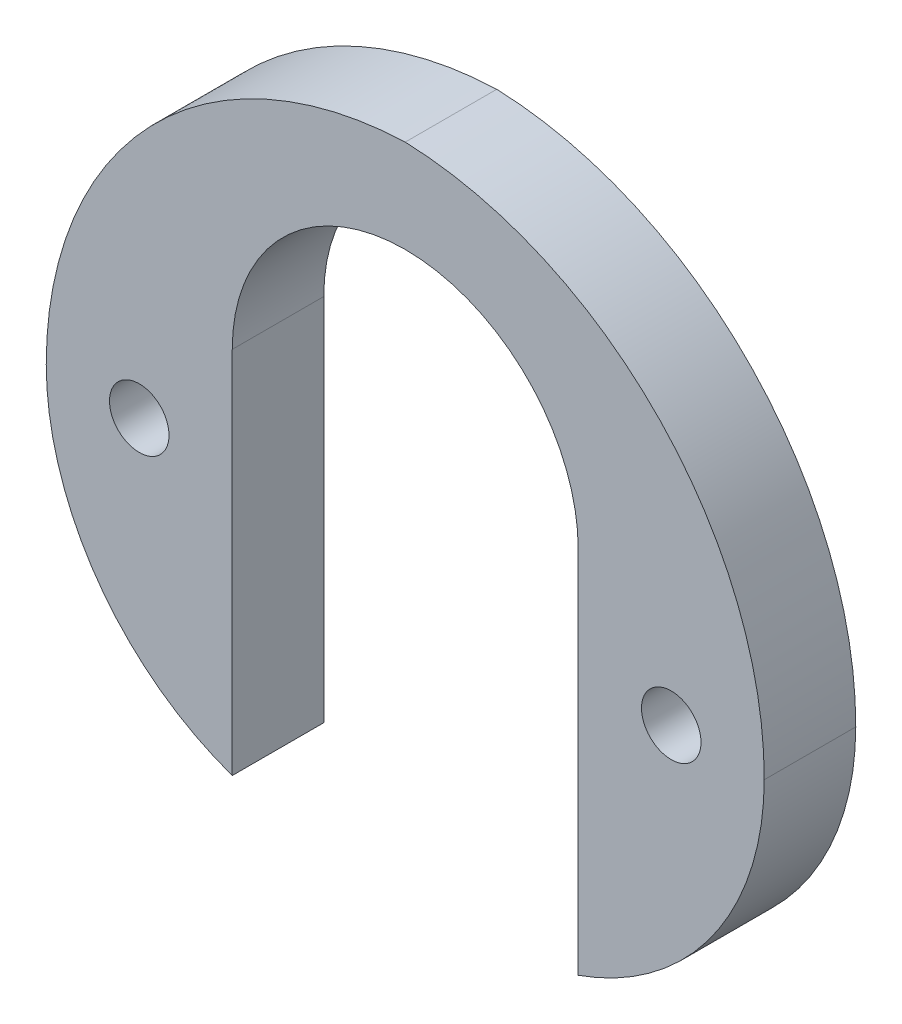
ISO-10303-21;
HEADER;
FILE_DESCRIPTION(('STEP AP214'),'2;1');
FILE_NAME('part.step','',(''),(''),'','','');
FILE_SCHEMA(('AUTOMOTIVE_DESIGN { 1 0 10303 214 1 1 1 1 }'));
ENDSEC;
DATA;
#1=APPLICATION_CONTEXT('core data for automotive mechanical design processes');
#2=APPLICATION_PROTOCOL_DEFINITION('international standard','automotive_design',2000,#1);
#3=PRODUCT_CONTEXT('',#1,'mechanical');
#4=PRODUCT('Part','Part','',(#3));
#5=PRODUCT_RELATED_PRODUCT_CATEGORY('part','',(#4));
#6=PRODUCT_DEFINITION_FORMATION('','',#4);
#7=PRODUCT_DEFINITION_CONTEXT('part definition',#1,'design');
#8=PRODUCT_DEFINITION('design','',#6,#7);
#9=PRODUCT_DEFINITION_SHAPE('','',#8);
#10=(LENGTH_UNIT() NAMED_UNIT(*) SI_UNIT(.MILLI.,.METRE.));
#11=(NAMED_UNIT(*) PLANE_ANGLE_UNIT() SI_UNIT($,.RADIAN.));
#12=(NAMED_UNIT(*) SI_UNIT($,.STERADIAN.) SOLID_ANGLE_UNIT());
#13=UNCERTAINTY_MEASURE_WITH_UNIT(LENGTH_MEASURE(1.E-05),#10,'distance_accuracy_value','');
#14=(GEOMETRIC_REPRESENTATION_CONTEXT(3) GLOBAL_UNCERTAINTY_ASSIGNED_CONTEXT((#13)) GLOBAL_UNIT_ASSIGNED_CONTEXT((#10,
#11,#12)) REPRESENTATION_CONTEXT('',''));
#15=CARTESIAN_POINT('',(0.,0.,0.));
#16=DIRECTION('',(0.,0.,1.));
#17=DIRECTION('',(1.,0.,0.));
#18=AXIS2_PLACEMENT_3D('',#15,#16,#17);
#19=CARTESIAN_POINT('',(0.,3.6195,3.1242));
#20=DIRECTION('',(0.,0.,-1.));
#21=DIRECTION('',(-1.,0.,0.));
#22=AXIS2_PLACEMENT_3D('',#19,#20,#21);
#23=CYLINDRICAL_SURFACE('',#22,5.9055);
#24=CARTESIAN_POINT('',(0.,3.6195,0.));
#25=DIRECTION('',(0.,0.,1.));
#26=DIRECTION('',(1.,0.,0.));
#27=AXIS2_PLACEMENT_3D('',#24,#25,#26);
#28=CIRCLE('',#27,5.9055);
#29=CARTESIAN_POINT('',(5.90550000000001,3.6195,0.));
#30=VERTEX_POINT('',#29);
#31=CARTESIAN_POINT('',(-5.9055,3.6195,0.));
#32=VERTEX_POINT('',#31);
#33=EDGE_CURVE('E132',#30,#32,#28,.T.);
#34=ORIENTED_EDGE('',*,*,#33,.F.);
#35=DIRECTION('',(0.,0.,-1.));
#36=VECTOR('',#35,1.);
#37=CARTESIAN_POINT('',(5.90550000000001,3.6195,3.1242));
#38=LINE('',#37,#36);
#39=CARTESIAN_POINT('',(5.90550000000001,3.6195,3.1242));
#40=VERTEX_POINT('',#39);
#41=EDGE_CURVE('E11',#40,#30,#38,.T.);
#42=ORIENTED_EDGE('',*,*,#41,.F.);
#43=CARTESIAN_POINT('',(0.,3.6195,3.1242));
#44=DIRECTION('',(0.,0.,1.));
#45=DIRECTION('',(1.,0.,0.));
#46=AXIS2_PLACEMENT_3D('',#43,#44,#45);
#47=CIRCLE('',#46,5.9055);
#48=CARTESIAN_POINT('',(-5.9055,3.6195,3.1242));
#49=VERTEX_POINT('',#48);
#50=EDGE_CURVE('E154',#40,#49,#47,.T.);
#51=ORIENTED_EDGE('',*,*,#50,.T.);
#52=DIRECTION('',(0.,0.,-1.));
#53=VECTOR('',#52,1.);
#54=CARTESIAN_POINT('',(-5.9055,3.6195,3.1242));
#55=LINE('',#54,#53);
#56=EDGE_CURVE('E52',#49,#32,#55,.T.);
#57=ORIENTED_EDGE('',*,*,#56,.T.);
#58=EDGE_LOOP('',(#34,#42,#51,#57));
#59=FACE_BOUND('',#58,.T.);
#60=ADVANCED_FACE('F36',(#59),#23,.F.);
#61=CARTESIAN_POINT('',(5.90550000000001,0.,3.1242));
#62=DIRECTION('',(1.,0.,0.));
#63=DIRECTION('',(0.,0.,-1.));
#64=AXIS2_PLACEMENT_3D('',#61,#62,#63);
#65=PLANE('',#64);
#66=DIRECTION('',(0.,-1.,0.));
#67=VECTOR('',#66,1.);
#68=CARTESIAN_POINT('',(5.90550000000001,0.,0.));
#69=LINE('',#68,#67);
#70=CARTESIAN_POINT('',(5.90550000000001,-8.98025612106916,0.));
#71=VERTEX_POINT('',#70);
#72=EDGE_CURVE('E134',#30,#71,#69,.T.);
#73=ORIENTED_EDGE('',*,*,#72,.T.);
#74=DIRECTION('',(0.,0.,-1.));
#75=VECTOR('',#74,1.);
#76=CARTESIAN_POINT('',(5.90550000000001,-8.98025612106916,3.1242));
#77=LINE('',#76,#75);
#78=CARTESIAN_POINT('',(5.90550000000001,-8.98025612106916,3.1242));
#79=VERTEX_POINT('',#78);
#80=EDGE_CURVE('E44',#79,#71,#77,.T.);
#81=ORIENTED_EDGE('',*,*,#80,.F.);
#82=DIRECTION('',(0.,-1.,0.));
#83=VECTOR('',#82,1.);
#84=CARTESIAN_POINT('',(5.90550000000001,0.,3.1242));
#85=LINE('',#84,#83);
#86=EDGE_CURVE('E298',#40,#79,#85,.T.);
#87=ORIENTED_EDGE('',*,*,#86,.F.);
#88=ORIENTED_EDGE('',*,*,#41,.T.);
#89=EDGE_LOOP('',(#73,#81,#87,#88));
#90=FACE_BOUND('',#89,.T.);
#91=ADVANCED_FACE('F181',(#90),#65,.F.);
#92=CARTESIAN_POINT('',(2.73050000000001,0.,3.1242));
#93=DIRECTION('',(0.,0.,-1.));
#94=DIRECTION('',(-1.,0.,0.));
#95=AXIS2_PLACEMENT_3D('',#92,#93,#94);
#96=CYLINDRICAL_SURFACE('',#95,9.525);
#97=CARTESIAN_POINT('',(2.73050000000001,0.,0.));
#98=DIRECTION('',(0.,0.,1.));
#99=DIRECTION('',(1.,0.,0.));
#100=AXIS2_PLACEMENT_3D('',#97,#98,#99);
#101=CIRCLE('',#100,9.525);
#102=CARTESIAN_POINT('',(12.2554713979827,-0.0233423994337108,0.));
#103=VERTEX_POINT('',#102);
#104=EDGE_CURVE('E136',#71,#103,#101,.T.);
#105=ORIENTED_EDGE('',*,*,#104,.T.);
#106=DIRECTION('',(0.,0.,-1.));
#107=VECTOR('',#106,1.);
#108=CARTESIAN_POINT('',(12.2554713979827,-0.0233423994337108,3.1242));
#109=LINE('',#108,#107);
#110=CARTESIAN_POINT('',(12.2554713979827,-0.0233423994337108,3.1242));
#111=VERTEX_POINT('',#110);
#112=EDGE_CURVE('E158',#111,#103,#109,.T.);
#113=ORIENTED_EDGE('',*,*,#112,.F.);
#114=CARTESIAN_POINT('',(2.73050000000001,0.,3.1242));
#115=DIRECTION('',(0.,0.,1.));
#116=DIRECTION('',(1.,0.,0.));
#117=AXIS2_PLACEMENT_3D('',#114,#115,#116);
#118=CIRCLE('',#117,9.525);
#119=EDGE_CURVE('E121',#79,#111,#118,.T.);
#120=ORIENTED_EDGE('',*,*,#119,.F.);
#121=ORIENTED_EDGE('',*,*,#80,.T.);
#122=EDGE_LOOP('',(#105,#113,#120,#121));
#123=FACE_BOUND('',#122,.T.);
#124=ADVANCED_FACE('F164',(#123),#96,.T.);
#125=CARTESIAN_POINT('',(-0.444490465994227,0.00778079981123838,3.1242));
#126=DIRECTION('',(0.,0.,-1.));
#127=DIRECTION('',(-1.,0.,0.));
#128=AXIS2_PLACEMENT_3D('',#125,#126,#127);
#129=CYLINDRICAL_SURFACE('',#128,12.7);
#130=CARTESIAN_POINT('',(-0.444490465994227,0.00778079981123838,0.));
#131=DIRECTION('',(0.,0.,1.));
#132=DIRECTION('',(1.,0.,0.));
#133=AXIS2_PLACEMENT_3D('',#130,#131,#132);
#134=CIRCLE('',#133,12.7);
#135=CARTESIAN_POINT('',(0.,12.7,0.));
#136=VERTEX_POINT('',#135);
#137=EDGE_CURVE('E139',#136,#103,#134,.F.);
#138=ORIENTED_EDGE('',*,*,#137,.F.);
#139=DIRECTION('',(0.,0.,-1.));
#140=VECTOR('',#139,1.);
#141=CARTESIAN_POINT('',(0.,12.7,3.1242));
#142=LINE('',#141,#140);
#143=CARTESIAN_POINT('',(0.,12.7,3.1242));
#144=VERTEX_POINT('',#143);
#145=EDGE_CURVE('E106',#144,#136,#142,.T.);
#146=ORIENTED_EDGE('',*,*,#145,.F.);
#147=CARTESIAN_POINT('',(-0.444490465994227,0.00778079981123838,3.1242));
#148=DIRECTION('',(0.,0.,1.));
#149=DIRECTION('',(1.,0.,0.));
#150=AXIS2_PLACEMENT_3D('',#147,#148,#149);
#151=CIRCLE('',#150,12.7);
#152=EDGE_CURVE('E119',#144,#111,#151,.F.);
#153=ORIENTED_EDGE('',*,*,#152,.T.);
#154=ORIENTED_EDGE('',*,*,#112,.T.);
#155=EDGE_LOOP('',(#138,#146,#153,#154));
#156=FACE_BOUND('',#155,.T.);
#157=ADVANCED_FACE('F173',(#156),#129,.T.);
#158=CARTESIAN_POINT('',(0.45256088082901,0.,3.1242));
#159=DIRECTION('',(0.,0.,-1.));
#160=DIRECTION('',(-1.,0.,0.));
#161=AXIS2_PLACEMENT_3D('',#158,#159,#160);
#162=CYLINDRICAL_SURFACE('',#161,12.708060880829);
#163=CARTESIAN_POINT('',(0.45256088082901,0.,0.));
#164=DIRECTION('',(0.,0.,1.));
#165=DIRECTION('',(1.,0.,0.));
#166=AXIS2_PLACEMENT_3D('',#163,#164,#165);
#167=CIRCLE('',#166,12.708060880829);
#168=CARTESIAN_POINT('',(-12.2555,0.,0.));
#169=VERTEX_POINT('',#168);
#170=EDGE_CURVE('E103',#169,#136,#167,.F.);
#171=ORIENTED_EDGE('',*,*,#170,.F.);
#172=DIRECTION('',(0.,0.,-1.));
#173=VECTOR('',#172,1.);
#174=CARTESIAN_POINT('',(-12.2555,0.,3.1242));
#175=LINE('',#174,#173);
#176=CARTESIAN_POINT('',(-12.2555,0.,3.1242));
#177=VERTEX_POINT('',#176);
#178=EDGE_CURVE('E97',#177,#169,#175,.T.);
#179=ORIENTED_EDGE('',*,*,#178,.F.);
#180=CARTESIAN_POINT('',(0.45256088082901,0.,3.1242));
#181=DIRECTION('',(0.,0.,1.));
#182=DIRECTION('',(1.,0.,0.));
#183=AXIS2_PLACEMENT_3D('',#180,#181,#182);
#184=CIRCLE('',#183,12.708060880829);
#185=EDGE_CURVE('E101',#177,#144,#184,.F.);
#186=ORIENTED_EDGE('',*,*,#185,.T.);
#187=ORIENTED_EDGE('',*,*,#145,.T.);
#188=EDGE_LOOP('',(#171,#179,#186,#187));
#189=FACE_BOUND('',#188,.T.);
#190=ADVANCED_FACE('F99',(#189),#162,.T.);
#191=CARTESIAN_POINT('',(-2.73050000000001,0.,3.1242));
#192=DIRECTION('',(0.,0.,-1.));
#193=DIRECTION('',(-1.,0.,0.));
#194=AXIS2_PLACEMENT_3D('',#191,#192,#193);
#195=CYLINDRICAL_SURFACE('',#194,9.525);
#196=CARTESIAN_POINT('',(-2.73050000000001,0.,0.));
#197=DIRECTION('',(0.,0.,1.));
#198=DIRECTION('',(1.,0.,0.));
#199=AXIS2_PLACEMENT_3D('',#196,#197,#198);
#200=CIRCLE('',#199,9.525);
#201=CARTESIAN_POINT('',(-5.9055,-8.98025612106916,0.));
#202=VERTEX_POINT('',#201);
#203=EDGE_CURVE('E143',#169,#202,#200,.T.);
#204=ORIENTED_EDGE('',*,*,#203,.T.);
#205=DIRECTION('',(0.,0.,-1.));
#206=VECTOR('',#205,1.);
#207=CARTESIAN_POINT('',(-5.9055,-8.98025612106916,3.1242));
#208=LINE('',#207,#206);
#209=CARTESIAN_POINT('',(-5.9055,-8.98025612106916,3.1242));
#210=VERTEX_POINT('',#209);
#211=EDGE_CURVE('E75',#210,#202,#208,.T.);
#212=ORIENTED_EDGE('',*,*,#211,.F.);
#213=CARTESIAN_POINT('',(-2.73050000000001,0.,3.1242));
#214=DIRECTION('',(0.,0.,1.));
#215=DIRECTION('',(1.,0.,0.));
#216=AXIS2_PLACEMENT_3D('',#213,#214,#215);
#217=CIRCLE('',#216,9.525);
#218=EDGE_CURVE('E108',#177,#210,#217,.T.);
#219=ORIENTED_EDGE('',*,*,#218,.F.);
#220=ORIENTED_EDGE('',*,*,#178,.T.);
#221=EDGE_LOOP('',(#204,#212,#219,#220));
#222=FACE_BOUND('',#221,.T.);
#223=ADVANCED_FACE('F109',(#222),#195,.T.);
#224=CARTESIAN_POINT('',(-9.08050000000001,0.,3.1242));
#225=DIRECTION('',(0.,0.,-1.));
#226=DIRECTION('',(-1.,0.,0.));
#227=AXIS2_PLACEMENT_3D('',#224,#225,#226);
#228=CYLINDRICAL_SURFACE('',#227,1.016);
#229=CARTESIAN_POINT('',(-9.08050000000001,0.,3.1242));
#230=DIRECTION('',(0.,0.,1.));
#231=DIRECTION('',(1.,0.,0.));
#232=AXIS2_PLACEMENT_3D('',#229,#230,#231);
#233=CIRCLE('',#232,1.016);
#234=CARTESIAN_POINT('',(-8.06450000000001,0.,3.1242));
#235=VERTEX_POINT('',#234);
#236=EDGE_CURVE('E126',#235,#235,#233,.T.);
#237=ORIENTED_EDGE('',*,*,#236,.T.);
#238=EDGE_LOOP('',(#237));
#239=FACE_BOUND('',#238,.T.);
#240=CARTESIAN_POINT('',(-9.08050000000001,0.,0.));
#241=DIRECTION('',(0.,0.,1.));
#242=DIRECTION('',(1.,0.,0.));
#243=AXIS2_PLACEMENT_3D('',#240,#241,#242);
#244=CIRCLE('',#243,1.016);
#245=CARTESIAN_POINT('',(-8.06450000000001,0.,0.));
#246=VERTEX_POINT('',#245);
#247=EDGE_CURVE('E148',#246,#246,#244,.T.);
#248=ORIENTED_EDGE('',*,*,#247,.F.);
#249=EDGE_LOOP('',(#248));
#250=FACE_BOUND('',#249,.T.);
#251=ADVANCED_FACE('F190',(#239,#250),#228,.F.);
#252=CARTESIAN_POINT('',(-5.90550000000001,0.,3.1242));
#253=DIRECTION('',(1.,0.,0.));
#254=DIRECTION('',(0.,1.,0.));
#255=AXIS2_PLACEMENT_3D('',#252,#253,#254);
#256=PLANE('',#255);
#257=DIRECTION('',(0.,-1.,0.));
#258=VECTOR('',#257,1.);
#259=CARTESIAN_POINT('',(-5.90550000000001,0.,0.));
#260=LINE('',#259,#258);
#261=EDGE_CURVE('E145',#32,#202,#260,.T.);
#262=ORIENTED_EDGE('',*,*,#261,.F.);
#263=ORIENTED_EDGE('',*,*,#56,.F.);
#264=DIRECTION('',(0.,-1.,0.));
#265=VECTOR('',#264,1.);
#266=CARTESIAN_POINT('',(-5.90550000000001,0.,3.1242));
#267=LINE('',#266,#265);
#268=EDGE_CURVE('E112',#49,#210,#267,.T.);
#269=ORIENTED_EDGE('',*,*,#268,.T.);
#270=ORIENTED_EDGE('',*,*,#211,.T.);
#271=EDGE_LOOP('',(#262,#263,#269,#270));
#272=FACE_BOUND('',#271,.T.);
#273=ADVANCED_FACE('F187',(#272),#256,.T.);
#274=CARTESIAN_POINT('',(9.08050000000001,0.,3.1242));
#275=DIRECTION('',(0.,0.,-1.));
#276=DIRECTION('',(-1.,0.,0.));
#277=AXIS2_PLACEMENT_3D('',#274,#275,#276);
#278=CYLINDRICAL_SURFACE('',#277,1.016);
#279=CARTESIAN_POINT('',(9.08050000000001,0.,3.1242));
#280=DIRECTION('',(0.,0.,1.));
#281=DIRECTION('',(1.,0.,0.));
#282=AXIS2_PLACEMENT_3D('',#279,#280,#281);
#283=CIRCLE('',#282,1.016);
#284=CARTESIAN_POINT('',(10.0965,0.,3.1242));
#285=VERTEX_POINT('',#284);
#286=EDGE_CURVE('E129',#285,#285,#283,.T.);
#287=ORIENTED_EDGE('',*,*,#286,.T.);
#288=EDGE_LOOP('',(#287));
#289=FACE_BOUND('',#288,.T.);
#290=CARTESIAN_POINT('',(9.08050000000001,0.,0.));
#291=DIRECTION('',(0.,0.,1.));
#292=DIRECTION('',(1.,0.,0.));
#293=AXIS2_PLACEMENT_3D('',#290,#291,#292);
#294=CIRCLE('',#293,1.016);
#295=CARTESIAN_POINT('',(10.0965,0.,0.));
#296=VERTEX_POINT('',#295);
#297=EDGE_CURVE('E151',#296,#296,#294,.T.);
#298=ORIENTED_EDGE('',*,*,#297,.F.);
#299=EDGE_LOOP('',(#298));
#300=FACE_BOUND('',#299,.T.);
#301=ADVANCED_FACE('F189',(#289,#300),#278,.F.);
#302=CARTESIAN_POINT('',(0.,0.,3.1242));
#303=DIRECTION('',(0.,0.,1.));
#304=DIRECTION('',(1.,0.,0.));
#305=AXIS2_PLACEMENT_3D('',#302,#303,#304);
#306=PLANE('',#305);
#307=ORIENTED_EDGE('',*,*,#50,.F.);
#308=ORIENTED_EDGE('',*,*,#86,.T.);
#309=ORIENTED_EDGE('',*,*,#119,.T.);
#310=ORIENTED_EDGE('',*,*,#152,.F.);
#311=ORIENTED_EDGE('',*,*,#185,.F.);
#312=ORIENTED_EDGE('',*,*,#218,.T.);
#313=ORIENTED_EDGE('',*,*,#268,.F.);
#314=EDGE_LOOP('',(#307,#308,#309,#310,#311,#312,#313));
#315=FACE_BOUND('',#314,.T.);
#316=ORIENTED_EDGE('',*,*,#236,.F.);
#317=EDGE_LOOP('',(#316));
#318=FACE_BOUND('',#317,.T.);
#319=ORIENTED_EDGE('',*,*,#286,.F.);
#320=EDGE_LOOP('',(#319));
#321=FACE_BOUND('',#320,.T.);
#322=ADVANCED_FACE('F116',(#315,#318,#321),#306,.T.);
#323=CARTESIAN_POINT('',(0.,0.,0.));
#324=DIRECTION('',(0.,0.,1.));
#325=DIRECTION('',(1.,0.,0.));
#326=AXIS2_PLACEMENT_3D('',#323,#324,#325);
#327=PLANE('',#326);
#328=ORIENTED_EDGE('',*,*,#33,.T.);
#329=ORIENTED_EDGE('',*,*,#261,.T.);
#330=ORIENTED_EDGE('',*,*,#203,.F.);
#331=ORIENTED_EDGE('',*,*,#170,.T.);
#332=ORIENTED_EDGE('',*,*,#137,.T.);
#333=ORIENTED_EDGE('',*,*,#104,.F.);
#334=ORIENTED_EDGE('',*,*,#72,.F.);
#335=EDGE_LOOP('',(#328,#329,#330,#331,#332,#333,#334));
#336=FACE_BOUND('',#335,.T.);
#337=ORIENTED_EDGE('',*,*,#247,.T.);
#338=EDGE_LOOP('',(#337));
#339=FACE_BOUND('',#338,.T.);
#340=ORIENTED_EDGE('',*,*,#297,.T.);
#341=EDGE_LOOP('',(#340));
#342=FACE_BOUND('',#341,.T.);
#343=ADVANCED_FACE('F169',(#336,#339,#342),#327,.F.);
#344=CLOSED_SHELL('',(#60,#91,#124,#157,#190,#223,#251,#273,#301,#322,#343));
#345=MANIFOLD_SOLID_BREP('B2',#344);
#346=ADVANCED_BREP_SHAPE_REPRESENTATION('',(#18,#345),#14);
#347=SHAPE_DEFINITION_REPRESENTATION(#9,#346);
ENDSEC;
END-ISO-10303-21;
